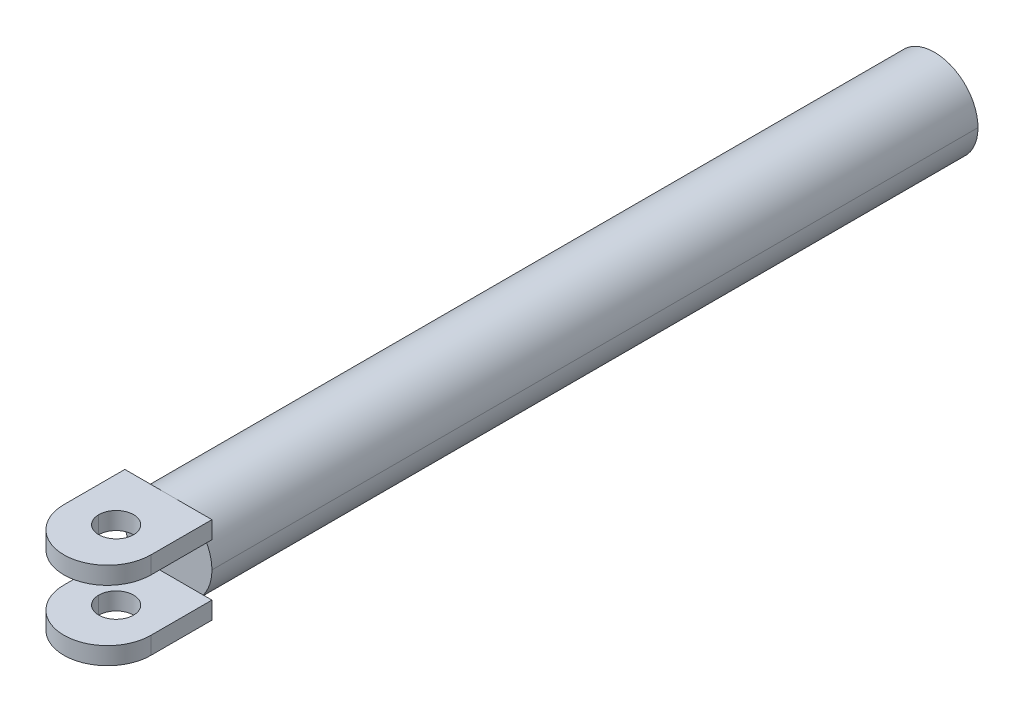
ISO-10303-21;
HEADER;
FILE_DESCRIPTION(('STEP AP214'),'2;1');
FILE_NAME('part.step','',(''),(''),'','','');
FILE_SCHEMA(('AUTOMOTIVE_DESIGN { 1 0 10303 214 1 1 1 1 }'));
ENDSEC;
DATA;
#1=APPLICATION_CONTEXT('core data for automotive mechanical design processes');
#2=APPLICATION_PROTOCOL_DEFINITION('international standard','automotive_design',2000,#1);
#3=PRODUCT_CONTEXT('',#1,'mechanical');
#4=PRODUCT('Part','Part','',(#3));
#5=PRODUCT_RELATED_PRODUCT_CATEGORY('part','',(#4));
#6=PRODUCT_DEFINITION_FORMATION('','',#4);
#7=PRODUCT_DEFINITION_CONTEXT('part definition',#1,'design');
#8=PRODUCT_DEFINITION('design','',#6,#7);
#9=PRODUCT_DEFINITION_SHAPE('','',#8);
#10=(LENGTH_UNIT() NAMED_UNIT(*) SI_UNIT(.MILLI.,.METRE.));
#11=(NAMED_UNIT(*) PLANE_ANGLE_UNIT() SI_UNIT($,.RADIAN.));
#12=(NAMED_UNIT(*) SI_UNIT($,.STERADIAN.) SOLID_ANGLE_UNIT());
#13=UNCERTAINTY_MEASURE_WITH_UNIT(LENGTH_MEASURE(1.E-05),#10,'distance_accuracy_value','');
#14=(GEOMETRIC_REPRESENTATION_CONTEXT(3) GLOBAL_UNCERTAINTY_ASSIGNED_CONTEXT((#13)) GLOBAL_UNIT_ASSIGNED_CONTEXT((#10,
#11,#12)) REPRESENTATION_CONTEXT('',''));
#15=CARTESIAN_POINT('',(0.,0.,0.));
#16=DIRECTION('',(0.,0.,1.));
#17=DIRECTION('',(1.,0.,0.));
#18=AXIS2_PLACEMENT_3D('',#15,#16,#17);
#19=CARTESIAN_POINT('',(0.,25.,470.));
#20=DIRECTION('',(0.,1.,0.));
#21=DIRECTION('',(1.,0.,0.));
#22=AXIS2_PLACEMENT_3D('',#19,#20,#21);
#23=CYLINDRICAL_SURFACE('',#22,10.);
#24=DIRECTION('',(0.,-1.,0.));
#25=VECTOR('',#24,1.);
#26=CARTESIAN_POINT('',(-10.,25.,470.));
#27=LINE('',#26,#25);
#28=CARTESIAN_POINT('',(-10.,25.,470.));
#29=VERTEX_POINT('',#28);
#30=CARTESIAN_POINT('',(-10.,15.,470.));
#31=VERTEX_POINT('',#30);
#32=EDGE_CURVE('E20',#29,#31,#27,.T.);
#33=ORIENTED_EDGE('',*,*,#32,.F.);
#34=CARTESIAN_POINT('',(0.,25.,470.));
#35=DIRECTION('',(0.,1.,0.));
#36=DIRECTION('',(-1.,0.,0.));
#37=AXIS2_PLACEMENT_3D('',#34,#35,#36);
#38=CIRCLE('',#37,10.);
#39=CARTESIAN_POINT('',(10.,25.,470.));
#40=VERTEX_POINT('',#39);
#41=EDGE_CURVE('E266',#29,#40,#38,.T.);
#42=ORIENTED_EDGE('',*,*,#41,.T.);
#43=DIRECTION('',(0.,-1.,0.));
#44=VECTOR('',#43,1.);
#45=CARTESIAN_POINT('',(10.,25.,470.));
#46=LINE('',#45,#44);
#47=CARTESIAN_POINT('',(10.,15.,470.));
#48=VERTEX_POINT('',#47);
#49=EDGE_CURVE('E11',#40,#48,#46,.T.);
#50=ORIENTED_EDGE('',*,*,#49,.T.);
#51=CARTESIAN_POINT('',(0.,15.,470.));
#52=DIRECTION('',(0.,1.,0.));
#53=DIRECTION('',(-1.,0.,0.));
#54=AXIS2_PLACEMENT_3D('',#51,#52,#53);
#55=CIRCLE('',#54,10.);
#56=EDGE_CURVE('E239',#31,#48,#55,.T.);
#57=ORIENTED_EDGE('',*,*,#56,.F.);
#58=EDGE_LOOP('',(#33,#42,#50,#57));
#59=FACE_BOUND('',#58,.T.);
#60=ADVANCED_FACE('F17',(#59),#23,.F.);
#61=CARTESIAN_POINT('',(0.,25.,470.));
#62=DIRECTION('',(0.,1.,0.));
#63=DIRECTION('',(1.,0.,0.));
#64=AXIS2_PLACEMENT_3D('',#61,#62,#63);
#65=CYLINDRICAL_SURFACE('',#64,10.);
#66=ORIENTED_EDGE('',*,*,#49,.F.);
#67=CARTESIAN_POINT('',(0.,25.,470.));
#68=DIRECTION('',(0.,1.,0.));
#69=DIRECTION('',(1.,0.,0.));
#70=AXIS2_PLACEMENT_3D('',#67,#68,#69);
#71=CIRCLE('',#70,10.);
#72=EDGE_CURVE('E263',#40,#29,#71,.T.);
#73=ORIENTED_EDGE('',*,*,#72,.T.);
#74=ORIENTED_EDGE('',*,*,#32,.T.);
#75=CARTESIAN_POINT('',(0.,15.,470.));
#76=DIRECTION('',(0.,1.,0.));
#77=DIRECTION('',(1.,0.,0.));
#78=AXIS2_PLACEMENT_3D('',#75,#76,#77);
#79=CIRCLE('',#78,10.);
#80=EDGE_CURVE('E243',#48,#31,#79,.T.);
#81=ORIENTED_EDGE('',*,*,#80,.F.);
#82=EDGE_LOOP('',(#66,#73,#74,#81));
#83=FACE_BOUND('',#82,.T.);
#84=ADVANCED_FACE('F286',(#83),#65,.F.);
#85=CARTESIAN_POINT('',(25.,0.,0.));
#86=DIRECTION('',(1.,0.,0.));
#87=DIRECTION('',(0.,-1.,0.));
#88=AXIS2_PLACEMENT_3D('',#85,#86,#87);
#89=PLANE('',#88);
#90=DIRECTION('',(0.,0.,-1.));
#91=VECTOR('',#90,1.);
#92=CARTESIAN_POINT('',(25.,15.,475.));
#93=LINE('',#92,#91);
#94=CARTESIAN_POINT('',(25.,15.,475.));
#95=VERTEX_POINT('',#94);
#96=CARTESIAN_POINT('',(25.,15.,440.));
#97=VERTEX_POINT('',#96);
#98=EDGE_CURVE('E232',#95,#97,#93,.T.);
#99=ORIENTED_EDGE('',*,*,#98,.T.);
#100=DIRECTION('',(0.,1.,0.));
#101=VECTOR('',#100,1.);
#102=CARTESIAN_POINT('',(25.,15.,440.));
#103=LINE('',#102,#101);
#104=CARTESIAN_POINT('',(25.,25.,440.));
#105=VERTEX_POINT('',#104);
#106=EDGE_CURVE('E268',#97,#105,#103,.T.);
#107=ORIENTED_EDGE('',*,*,#106,.T.);
#108=DIRECTION('',(0.,0.,1.));
#109=VECTOR('',#108,1.);
#110=CARTESIAN_POINT('',(25.,25.,440.));
#111=LINE('',#110,#109);
#112=CARTESIAN_POINT('',(25.,25.,475.));
#113=VERTEX_POINT('',#112);
#114=EDGE_CURVE('E262',#105,#113,#111,.T.);
#115=ORIENTED_EDGE('',*,*,#114,.T.);
#116=DIRECTION('',(0.,1.,0.));
#117=VECTOR('',#116,1.);
#118=CARTESIAN_POINT('',(25.,15.,475.));
#119=LINE('',#118,#117);
#120=EDGE_CURVE('E249',#95,#113,#119,.T.);
#121=ORIENTED_EDGE('',*,*,#120,.F.);
#122=EDGE_LOOP('',(#99,#107,#115,#121));
#123=FACE_BOUND('',#122,.T.);
#124=ADVANCED_FACE('F300',(#123),#89,.T.);
#125=CARTESIAN_POINT('',(-25.,-25.,440.));
#126=DIRECTION('',(0.,0.,-1.));
#127=DIRECTION('',(0.,1.,0.));
#128=AXIS2_PLACEMENT_3D('',#125,#126,#127);
#129=PLANE('',#128);
#130=CARTESIAN_POINT('',(0.,0.,440.));
#131=DIRECTION('',(0.,0.,1.));
#132=DIRECTION('',(0.8,0.6,0.));
#133=AXIS2_PLACEMENT_3D('',#130,#131,#132);
#134=CIRCLE('',#133,25.);
#135=CARTESIAN_POINT('',(20.,15.,440.));
#136=VERTEX_POINT('',#135);
#137=CARTESIAN_POINT('',(0.,25.,440.));
#138=VERTEX_POINT('',#137);
#139=EDGE_CURVE('E160',#136,#138,#134,.T.);
#140=ORIENTED_EDGE('',*,*,#139,.T.);
#141=DIRECTION('',(1.,0.,0.));
#142=VECTOR('',#141,1.);
#143=CARTESIAN_POINT('',(0.,25.,440.));
#144=LINE('',#143,#142);
#145=EDGE_CURVE('E259',#138,#105,#144,.T.);
#146=ORIENTED_EDGE('',*,*,#145,.T.);
#147=ORIENTED_EDGE('',*,*,#106,.F.);
#148=DIRECTION('',(1.,0.,0.));
#149=VECTOR('',#148,1.);
#150=CARTESIAN_POINT('',(20.,15.,440.));
#151=LINE('',#150,#149);
#152=EDGE_CURVE('E254',#136,#97,#151,.T.);
#153=ORIENTED_EDGE('',*,*,#152,.F.);
#154=EDGE_LOOP('',(#140,#146,#147,#153));
#155=FACE_BOUND('',#154,.T.);
#156=ADVANCED_FACE('F294',(#155),#129,.T.);
#157=CARTESIAN_POINT('',(-25.,25.,440.));
#158=DIRECTION('',(0.,1.,0.));
#159=DIRECTION('',(0.,0.,1.));
#160=AXIS2_PLACEMENT_3D('',#157,#158,#159);
#161=PLANE('',#160);
#162=ORIENTED_EDGE('',*,*,#41,.F.);
#163=ORIENTED_EDGE('',*,*,#72,.F.);
#164=EDGE_LOOP('',(#162,#163));
#165=FACE_BOUND('',#164,.T.);
#166=ORIENTED_EDGE('',*,*,#114,.F.);
#167=ORIENTED_EDGE('',*,*,#145,.F.);
#168=DIRECTION('',(1.,0.,0.));
#169=VECTOR('',#168,1.);
#170=CARTESIAN_POINT('',(-25.,25.,440.));
#171=LINE('',#170,#169);
#172=CARTESIAN_POINT('',(-25.,25.,440.));
#173=VERTEX_POINT('',#172);
#174=EDGE_CURVE('E251',#173,#138,#171,.T.);
#175=ORIENTED_EDGE('',*,*,#174,.F.);
#176=DIRECTION('',(0.,0.,1.));
#177=VECTOR('',#176,1.);
#178=CARTESIAN_POINT('',(-25.,25.,440.));
#179=LINE('',#178,#177);
#180=CARTESIAN_POINT('',(-25.,25.,475.));
#181=VERTEX_POINT('',#180);
#182=EDGE_CURVE('E248',#173,#181,#179,.T.);
#183=ORIENTED_EDGE('',*,*,#182,.T.);
#184=CARTESIAN_POINT('',(0.,25.,475.));
#185=DIRECTION('',(0.,-1.,0.));
#186=DIRECTION('',(1.,0.,0.));
#187=AXIS2_PLACEMENT_3D('',#184,#185,#186);
#188=CIRCLE('',#187,25.);
#189=EDGE_CURVE('E238',#113,#181,#188,.T.);
#190=ORIENTED_EDGE('',*,*,#189,.F.);
#191=EDGE_LOOP('',(#166,#167,#175,#183,#190));
#192=FACE_BOUND('',#191,.T.);
#193=ADVANCED_FACE('F290',(#165,#192),#161,.T.);
#194=CARTESIAN_POINT('',(-25.,-25.,440.));
#195=DIRECTION('',(0.,0.,-1.));
#196=DIRECTION('',(0.,1.,0.));
#197=AXIS2_PLACEMENT_3D('',#194,#195,#196);
#198=PLANE('',#197);
#199=DIRECTION('',(0.,1.,0.));
#200=VECTOR('',#199,1.);
#201=CARTESIAN_POINT('',(-25.,15.,440.));
#202=LINE('',#201,#200);
#203=CARTESIAN_POINT('',(-25.,15.,440.));
#204=VERTEX_POINT('',#203);
#205=EDGE_CURVE('E245',#204,#173,#202,.T.);
#206=ORIENTED_EDGE('',*,*,#205,.T.);
#207=ORIENTED_EDGE('',*,*,#174,.T.);
#208=CARTESIAN_POINT('',(0.,0.,440.));
#209=DIRECTION('',(0.,0.,1.));
#210=DIRECTION('',(0.,1.,0.));
#211=AXIS2_PLACEMENT_3D('',#208,#209,#210);
#212=CIRCLE('',#211,25.);
#213=CARTESIAN_POINT('',(-20.,15.,440.));
#214=VERTEX_POINT('',#213);
#215=EDGE_CURVE('E162',#138,#214,#212,.T.);
#216=ORIENTED_EDGE('',*,*,#215,.T.);
#217=DIRECTION('',(1.,0.,0.));
#218=VECTOR('',#217,1.);
#219=CARTESIAN_POINT('',(-25.,15.,440.));
#220=LINE('',#219,#218);
#221=EDGE_CURVE('E244',#204,#214,#220,.T.);
#222=ORIENTED_EDGE('',*,*,#221,.F.);
#223=EDGE_LOOP('',(#206,#207,#216,#222));
#224=FACE_BOUND('',#223,.T.);
#225=ADVANCED_FACE('F293',(#224),#198,.T.);
#226=CARTESIAN_POINT('',(-25.,0.,0.));
#227=DIRECTION('',(1.,0.,0.));
#228=DIRECTION('',(0.,-1.,0.));
#229=AXIS2_PLACEMENT_3D('',#226,#227,#228);
#230=PLANE('',#229);
#231=ORIENTED_EDGE('',*,*,#182,.F.);
#232=ORIENTED_EDGE('',*,*,#205,.F.);
#233=DIRECTION('',(0.,0.,-1.));
#234=VECTOR('',#233,1.);
#235=CARTESIAN_POINT('',(-25.,15.,475.));
#236=LINE('',#235,#234);
#237=CARTESIAN_POINT('',(-25.,15.,475.));
#238=VERTEX_POINT('',#237);
#239=EDGE_CURVE('E240',#238,#204,#236,.T.);
#240=ORIENTED_EDGE('',*,*,#239,.F.);
#241=DIRECTION('',(0.,-1.,0.));
#242=VECTOR('',#241,1.);
#243=CARTESIAN_POINT('',(-25.,25.,475.));
#244=LINE('',#243,#242);
#245=EDGE_CURVE('E235',#181,#238,#244,.T.);
#246=ORIENTED_EDGE('',*,*,#245,.F.);
#247=EDGE_LOOP('',(#231,#232,#240,#246));
#248=FACE_BOUND('',#247,.T.);
#249=ADVANCED_FACE('F359',(#248),#230,.F.);
#250=CARTESIAN_POINT('',(0.,-90.2542748175507,475.));
#251=DIRECTION('',(0.,1.,0.));
#252=DIRECTION('',(0.,0.,1.));
#253=AXIS2_PLACEMENT_3D('',#250,#251,#252);
#254=CYLINDRICAL_SURFACE('',#253,25.);
#255=ORIENTED_EDGE('',*,*,#120,.T.);
#256=ORIENTED_EDGE('',*,*,#189,.T.);
#257=ORIENTED_EDGE('',*,*,#245,.T.);
#258=CARTESIAN_POINT('',(0.,15.,475.));
#259=DIRECTION('',(0.,1.,0.));
#260=DIRECTION('',(-1.,0.,0.));
#261=AXIS2_PLACEMENT_3D('',#258,#259,#260);
#262=CIRCLE('',#261,25.);
#263=EDGE_CURVE('E229',#238,#95,#262,.T.);
#264=ORIENTED_EDGE('',*,*,#263,.T.);
#265=EDGE_LOOP('',(#255,#256,#257,#264));
#266=FACE_BOUND('',#265,.T.);
#267=ADVANCED_FACE('F362',(#266),#254,.T.);
#268=CARTESIAN_POINT('',(0.,15.,0.));
#269=DIRECTION('',(0.,1.,0.));
#270=DIRECTION('',(1.,0.,0.));
#271=AXIS2_PLACEMENT_3D('',#268,#269,#270);
#272=PLANE('',#271);
#273=ORIENTED_EDGE('',*,*,#56,.T.);
#274=ORIENTED_EDGE('',*,*,#80,.T.);
#275=EDGE_LOOP('',(#273,#274));
#276=FACE_BOUND('',#275,.T.);
#277=ORIENTED_EDGE('',*,*,#239,.T.);
#278=ORIENTED_EDGE('',*,*,#221,.T.);
#279=DIRECTION('',(-1.,0.,0.));
#280=VECTOR('',#279,1.);
#281=CARTESIAN_POINT('',(20.,15.,440.));
#282=LINE('',#281,#280);
#283=EDGE_CURVE('E170',#136,#214,#282,.T.);
#284=ORIENTED_EDGE('',*,*,#283,.F.);
#285=ORIENTED_EDGE('',*,*,#152,.T.);
#286=ORIENTED_EDGE('',*,*,#98,.F.);
#287=ORIENTED_EDGE('',*,*,#263,.F.);
#288=EDGE_LOOP('',(#277,#278,#284,#285,#286,#287));
#289=FACE_BOUND('',#288,.T.);
#290=ADVANCED_FACE('F279',(#276,#289),#272,.F.);
#291=CARTESIAN_POINT('',(0.,25.,470.));
#292=DIRECTION('',(0.,1.,0.));
#293=DIRECTION('',(1.,0.,0.));
#294=AXIS2_PLACEMENT_3D('',#291,#292,#293);
#295=CYLINDRICAL_SURFACE('',#294,10.);
#296=DIRECTION('',(0.,-1.,0.));
#297=VECTOR('',#296,1.);
#298=CARTESIAN_POINT('',(10.,-15.,470.));
#299=LINE('',#298,#297);
#300=CARTESIAN_POINT('',(10.,-15.,470.));
#301=VERTEX_POINT('',#300);
#302=CARTESIAN_POINT('',(10.,-25.,470.));
#303=VERTEX_POINT('',#302);
#304=EDGE_CURVE('E209',#301,#303,#299,.T.);
#305=ORIENTED_EDGE('',*,*,#304,.T.);
#306=CARTESIAN_POINT('',(0.,-25.,470.));
#307=DIRECTION('',(0.,1.,0.));
#308=DIRECTION('',(-1.,0.,0.));
#309=AXIS2_PLACEMENT_3D('',#306,#307,#308);
#310=CIRCLE('',#309,10.);
#311=CARTESIAN_POINT('',(-10.,-25.,470.));
#312=VERTEX_POINT('',#311);
#313=EDGE_CURVE('E197',#312,#303,#310,.T.);
#314=ORIENTED_EDGE('',*,*,#313,.F.);
#315=DIRECTION('',(0.,-1.,0.));
#316=VECTOR('',#315,1.);
#317=CARTESIAN_POINT('',(-10.,-15.,470.));
#318=LINE('',#317,#316);
#319=CARTESIAN_POINT('',(-10.,-15.,470.));
#320=VERTEX_POINT('',#319);
#321=EDGE_CURVE('E225',#320,#312,#318,.T.);
#322=ORIENTED_EDGE('',*,*,#321,.F.);
#323=CARTESIAN_POINT('',(0.,-15.,470.));
#324=DIRECTION('',(0.,1.,0.));
#325=DIRECTION('',(-1.,0.,0.));
#326=AXIS2_PLACEMENT_3D('',#323,#324,#325);
#327=CIRCLE('',#326,10.);
#328=EDGE_CURVE('E193',#320,#301,#327,.T.);
#329=ORIENTED_EDGE('',*,*,#328,.T.);
#330=EDGE_LOOP('',(#305,#314,#322,#329));
#331=FACE_BOUND('',#330,.T.);
#332=ADVANCED_FACE('F343',(#331),#295,.F.);
#333=CARTESIAN_POINT('',(0.,25.,470.));
#334=DIRECTION('',(0.,1.,0.));
#335=DIRECTION('',(1.,0.,0.));
#336=AXIS2_PLACEMENT_3D('',#333,#334,#335);
#337=CYLINDRICAL_SURFACE('',#336,10.);
#338=ORIENTED_EDGE('',*,*,#321,.T.);
#339=CARTESIAN_POINT('',(0.,-25.,470.));
#340=DIRECTION('',(0.,1.,0.));
#341=DIRECTION('',(1.,0.,0.));
#342=AXIS2_PLACEMENT_3D('',#339,#340,#341);
#343=CIRCLE('',#342,10.);
#344=EDGE_CURVE('E194',#303,#312,#343,.T.);
#345=ORIENTED_EDGE('',*,*,#344,.F.);
#346=ORIENTED_EDGE('',*,*,#304,.F.);
#347=CARTESIAN_POINT('',(0.,-15.,470.));
#348=DIRECTION('',(0.,1.,0.));
#349=DIRECTION('',(1.,0.,0.));
#350=AXIS2_PLACEMENT_3D('',#347,#348,#349);
#351=CIRCLE('',#350,10.);
#352=EDGE_CURVE('E206',#301,#320,#351,.T.);
#353=ORIENTED_EDGE('',*,*,#352,.T.);
#354=EDGE_LOOP('',(#338,#345,#346,#353));
#355=FACE_BOUND('',#354,.T.);
#356=ADVANCED_FACE('F335',(#355),#337,.F.);
#357=CARTESIAN_POINT('',(-25.,0.,0.));
#358=DIRECTION('',(1.,0.,0.));
#359=DIRECTION('',(0.,-1.,0.));
#360=AXIS2_PLACEMENT_3D('',#357,#358,#359);
#361=PLANE('',#360);
#362=DIRECTION('',(0.,0.,-1.));
#363=VECTOR('',#362,1.);
#364=CARTESIAN_POINT('',(-25.,-15.,475.));
#365=LINE('',#364,#363);
#366=CARTESIAN_POINT('',(-25.,-15.,475.));
#367=VERTEX_POINT('',#366);
#368=CARTESIAN_POINT('',(-25.,-15.,440.));
#369=VERTEX_POINT('',#368);
#370=EDGE_CURVE('E188',#367,#369,#365,.T.);
#371=ORIENTED_EDGE('',*,*,#370,.T.);
#372=DIRECTION('',(0.,1.,0.));
#373=VECTOR('',#372,1.);
#374=CARTESIAN_POINT('',(-25.,-25.,440.));
#375=LINE('',#374,#373);
#376=CARTESIAN_POINT('',(-25.,-25.,440.));
#377=VERTEX_POINT('',#376);
#378=EDGE_CURVE('E182',#377,#369,#375,.T.);
#379=ORIENTED_EDGE('',*,*,#378,.F.);
#380=DIRECTION('',(0.,0.,-1.));
#381=VECTOR('',#380,1.);
#382=CARTESIAN_POINT('',(-25.,-25.,475.));
#383=LINE('',#382,#381);
#384=CARTESIAN_POINT('',(-25.,-25.,475.));
#385=VERTEX_POINT('',#384);
#386=EDGE_CURVE('E198',#385,#377,#383,.T.);
#387=ORIENTED_EDGE('',*,*,#386,.F.);
#388=DIRECTION('',(0.,-1.,0.));
#389=VECTOR('',#388,1.);
#390=CARTESIAN_POINT('',(-25.,-15.,475.));
#391=LINE('',#390,#389);
#392=EDGE_CURVE('E40',#367,#385,#391,.T.);
#393=ORIENTED_EDGE('',*,*,#392,.F.);
#394=EDGE_LOOP('',(#371,#379,#387,#393));
#395=FACE_BOUND('',#394,.T.);
#396=ADVANCED_FACE('F333',(#395),#361,.F.);
#397=CARTESIAN_POINT('',(-25.,-25.,440.));
#398=DIRECTION('',(0.,0.,-1.));
#399=DIRECTION('',(0.,1.,0.));
#400=AXIS2_PLACEMENT_3D('',#397,#398,#399);
#401=PLANE('',#400);
#402=DIRECTION('',(0.,1.,0.));
#403=VECTOR('',#402,1.);
#404=CARTESIAN_POINT('',(25.,-25.,440.));
#405=LINE('',#404,#403);
#406=CARTESIAN_POINT('',(25.,-25.,440.));
#407=VERTEX_POINT('',#406);
#408=CARTESIAN_POINT('',(25.,-15.,440.));
#409=VERTEX_POINT('',#408);
#410=EDGE_CURVE('E201',#407,#409,#405,.T.);
#411=ORIENTED_EDGE('',*,*,#410,.F.);
#412=DIRECTION('',(1.,0.,0.));
#413=VECTOR('',#412,1.);
#414=CARTESIAN_POINT('',(0.,-25.,440.));
#415=LINE('',#414,#413);
#416=CARTESIAN_POINT('',(0.,-25.,440.));
#417=VERTEX_POINT('',#416);
#418=EDGE_CURVE('E212',#417,#407,#415,.T.);
#419=ORIENTED_EDGE('',*,*,#418,.F.);
#420=CARTESIAN_POINT('',(0.,0.,440.));
#421=DIRECTION('',(0.,0.,1.));
#422=DIRECTION('',(0.,-1.,0.));
#423=AXIS2_PLACEMENT_3D('',#420,#421,#422);
#424=CIRCLE('',#423,25.);
#425=CARTESIAN_POINT('',(20.,-15.,440.));
#426=VERTEX_POINT('',#425);
#427=EDGE_CURVE('E175',#417,#426,#424,.T.);
#428=ORIENTED_EDGE('',*,*,#427,.T.);
#429=DIRECTION('',(1.,0.,0.));
#430=VECTOR('',#429,1.);
#431=CARTESIAN_POINT('',(20.,-15.,440.));
#432=LINE('',#431,#430);
#433=EDGE_CURVE('E207',#426,#409,#432,.T.);
#434=ORIENTED_EDGE('',*,*,#433,.T.);
#435=EDGE_LOOP('',(#411,#419,#428,#434));
#436=FACE_BOUND('',#435,.T.);
#437=ADVANCED_FACE('F317',(#436),#401,.T.);
#438=CARTESIAN_POINT('',(25.,0.,0.));
#439=DIRECTION('',(1.,0.,0.));
#440=DIRECTION('',(0.,-1.,0.));
#441=AXIS2_PLACEMENT_3D('',#438,#439,#440);
#442=PLANE('',#441);
#443=DIRECTION('',(0.,0.,-1.));
#444=VECTOR('',#443,1.);
#445=CARTESIAN_POINT('',(25.,-25.,475.));
#446=LINE('',#445,#444);
#447=CARTESIAN_POINT('',(25.,-25.,475.));
#448=VERTEX_POINT('',#447);
#449=EDGE_CURVE('E204',#448,#407,#446,.T.);
#450=ORIENTED_EDGE('',*,*,#449,.T.);
#451=ORIENTED_EDGE('',*,*,#410,.T.);
#452=DIRECTION('',(0.,0.,-1.));
#453=VECTOR('',#452,1.);
#454=CARTESIAN_POINT('',(25.,-15.,475.));
#455=LINE('',#454,#453);
#456=CARTESIAN_POINT('',(25.,-15.,475.));
#457=VERTEX_POINT('',#456);
#458=EDGE_CURVE('E32',#457,#409,#455,.T.);
#459=ORIENTED_EDGE('',*,*,#458,.F.);
#460=DIRECTION('',(0.,1.,0.));
#461=VECTOR('',#460,1.);
#462=CARTESIAN_POINT('',(25.,-25.,475.));
#463=LINE('',#462,#461);
#464=EDGE_CURVE('E202',#448,#457,#463,.T.);
#465=ORIENTED_EDGE('',*,*,#464,.F.);
#466=EDGE_LOOP('',(#450,#451,#459,#465));
#467=FACE_BOUND('',#466,.T.);
#468=ADVANCED_FACE('F327',(#467),#442,.T.);
#469=CARTESIAN_POINT('',(-25.,-25.,500.));
#470=DIRECTION('',(0.,-1.,0.));
#471=DIRECTION('',(0.,0.,-1.));
#472=AXIS2_PLACEMENT_3D('',#469,#470,#471);
#473=PLANE('',#472);
#474=ORIENTED_EDGE('',*,*,#313,.T.);
#475=ORIENTED_EDGE('',*,*,#344,.T.);
#476=EDGE_LOOP('',(#474,#475));
#477=FACE_BOUND('',#476,.T.);
#478=ORIENTED_EDGE('',*,*,#386,.T.);
#479=DIRECTION('',(1.,0.,0.));
#480=VECTOR('',#479,1.);
#481=CARTESIAN_POINT('',(-25.,-25.,440.));
#482=LINE('',#481,#480);
#483=EDGE_CURVE('E183',#377,#417,#482,.T.);
#484=ORIENTED_EDGE('',*,*,#483,.T.);
#485=ORIENTED_EDGE('',*,*,#418,.T.);
#486=ORIENTED_EDGE('',*,*,#449,.F.);
#487=CARTESIAN_POINT('',(0.,-25.,475.));
#488=DIRECTION('',(0.,1.,0.));
#489=DIRECTION('',(-1.,0.,0.));
#490=AXIS2_PLACEMENT_3D('',#487,#488,#489);
#491=CIRCLE('',#490,25.);
#492=EDGE_CURVE('E190',#385,#448,#491,.T.);
#493=ORIENTED_EDGE('',*,*,#492,.F.);
#494=EDGE_LOOP('',(#478,#484,#485,#486,#493));
#495=FACE_BOUND('',#494,.T.);
#496=ADVANCED_FACE('F329',(#477,#495),#473,.T.);
#497=CARTESIAN_POINT('',(0.,-90.2542748175507,475.));
#498=DIRECTION('',(0.,1.,0.));
#499=DIRECTION('',(0.,0.,1.));
#500=AXIS2_PLACEMENT_3D('',#497,#498,#499);
#501=CYLINDRICAL_SURFACE('',#500,25.);
#502=ORIENTED_EDGE('',*,*,#464,.T.);
#503=CARTESIAN_POINT('',(0.,-15.,475.));
#504=DIRECTION('',(0.,-1.,0.));
#505=DIRECTION('',(1.,0.,0.));
#506=AXIS2_PLACEMENT_3D('',#503,#504,#505);
#507=CIRCLE('',#506,25.);
#508=EDGE_CURVE('E186',#457,#367,#507,.T.);
#509=ORIENTED_EDGE('',*,*,#508,.T.);
#510=ORIENTED_EDGE('',*,*,#392,.T.);
#511=ORIENTED_EDGE('',*,*,#492,.T.);
#512=EDGE_LOOP('',(#502,#509,#510,#511));
#513=FACE_BOUND('',#512,.T.);
#514=ADVANCED_FACE('F324',(#513),#501,.T.);
#515=CARTESIAN_POINT('',(0.,-15.,0.));
#516=DIRECTION('',(0.,1.,0.));
#517=DIRECTION('',(1.,0.,0.));
#518=AXIS2_PLACEMENT_3D('',#515,#516,#517);
#519=PLANE('',#518);
#520=ORIENTED_EDGE('',*,*,#328,.F.);
#521=ORIENTED_EDGE('',*,*,#352,.F.);
#522=EDGE_LOOP('',(#520,#521));
#523=FACE_BOUND('',#522,.T.);
#524=ORIENTED_EDGE('',*,*,#458,.T.);
#525=ORIENTED_EDGE('',*,*,#433,.F.);
#526=DIRECTION('',(-1.,0.,0.));
#527=VECTOR('',#526,1.);
#528=CARTESIAN_POINT('',(20.,-15.,440.));
#529=LINE('',#528,#527);
#530=CARTESIAN_POINT('',(-20.,-15.,440.));
#531=VERTEX_POINT('',#530);
#532=EDGE_CURVE('E171',#426,#531,#529,.T.);
#533=ORIENTED_EDGE('',*,*,#532,.T.);
#534=DIRECTION('',(1.,0.,0.));
#535=VECTOR('',#534,1.);
#536=CARTESIAN_POINT('',(-25.,-15.,440.));
#537=LINE('',#536,#535);
#538=EDGE_CURVE('E177',#369,#531,#537,.T.);
#539=ORIENTED_EDGE('',*,*,#538,.F.);
#540=ORIENTED_EDGE('',*,*,#370,.F.);
#541=ORIENTED_EDGE('',*,*,#508,.F.);
#542=EDGE_LOOP('',(#524,#525,#533,#539,#540,#541));
#543=FACE_BOUND('',#542,.T.);
#544=ADVANCED_FACE('F319',(#523,#543),#519,.T.);
#545=CARTESIAN_POINT('',(-25.,-25.,440.));
#546=DIRECTION('',(0.,0.,-1.));
#547=DIRECTION('',(0.,1.,0.));
#548=AXIS2_PLACEMENT_3D('',#545,#546,#547);
#549=PLANE('',#548);
#550=CARTESIAN_POINT('',(0.,0.,440.));
#551=DIRECTION('',(0.,0.,1.));
#552=DIRECTION('',(-0.8,-0.6,0.));
#553=AXIS2_PLACEMENT_3D('',#550,#551,#552);
#554=CIRCLE('',#553,25.);
#555=EDGE_CURVE('E172',#531,#417,#554,.T.);
#556=ORIENTED_EDGE('',*,*,#555,.T.);
#557=ORIENTED_EDGE('',*,*,#483,.F.);
#558=ORIENTED_EDGE('',*,*,#378,.T.);
#559=ORIENTED_EDGE('',*,*,#538,.T.);
#560=EDGE_LOOP('',(#556,#557,#558,#559));
#561=FACE_BOUND('',#560,.T.);
#562=ADVANCED_FACE('F332',(#561),#549,.T.);
#563=CARTESIAN_POINT('',(0.,0.,0.));
#564=DIRECTION('',(0.,0.,1.));
#565=DIRECTION('',(1.,0.,0.));
#566=AXIS2_PLACEMENT_3D('',#563,#564,#565);
#567=CYLINDRICAL_SURFACE('',#566,25.);
#568=DIRECTION('',(0.,0.,1.));
#569=VECTOR('',#568,1.);
#570=CARTESIAN_POINT('',(-25.,0.,0.));
#571=LINE('',#570,#569);
#572=CARTESIAN_POINT('',(-25.,0.,0.));
#573=VERTEX_POINT('',#572);
#574=CARTESIAN_POINT('',(-25.,0.,440.));
#575=VERTEX_POINT('',#574);
#576=EDGE_CURVE('E142',#573,#575,#571,.T.);
#577=ORIENTED_EDGE('',*,*,#576,.F.);
#578=CARTESIAN_POINT('',(0.,0.,0.));
#579=DIRECTION('',(0.,0.,1.));
#580=DIRECTION('',(-1.,0.,0.));
#581=AXIS2_PLACEMENT_3D('',#578,#579,#580);
#582=CIRCLE('',#581,25.);
#583=CARTESIAN_POINT('',(25.,0.,0.));
#584=VERTEX_POINT('',#583);
#585=EDGE_CURVE('E135',#573,#584,#582,.T.);
#586=ORIENTED_EDGE('',*,*,#585,.T.);
#587=DIRECTION('',(0.,0.,1.));
#588=VECTOR('',#587,1.);
#589=CARTESIAN_POINT('',(25.,0.,0.));
#590=LINE('',#589,#588);
#591=CARTESIAN_POINT('',(25.,0.,440.));
#592=VERTEX_POINT('',#591);
#593=EDGE_CURVE('E139',#584,#592,#590,.T.);
#594=ORIENTED_EDGE('',*,*,#593,.T.);
#595=CARTESIAN_POINT('',(0.,0.,440.));
#596=DIRECTION('',(0.,0.,1.));
#597=DIRECTION('',(0.8,-0.6,0.));
#598=AXIS2_PLACEMENT_3D('',#595,#596,#597);
#599=CIRCLE('',#598,25.);
#600=EDGE_CURVE('E154',#426,#592,#599,.T.);
#601=ORIENTED_EDGE('',*,*,#600,.F.);
#602=ORIENTED_EDGE('',*,*,#427,.F.);
#603=ORIENTED_EDGE('',*,*,#555,.F.);
#604=CARTESIAN_POINT('',(0.,0.,440.));
#605=DIRECTION('',(0.,0.,1.));
#606=DIRECTION('',(-1.,0.,0.));
#607=AXIS2_PLACEMENT_3D('',#604,#605,#606);
#608=CIRCLE('',#607,25.);
#609=EDGE_CURVE('E167',#575,#531,#608,.T.);
#610=ORIENTED_EDGE('',*,*,#609,.F.);
#611=EDGE_LOOP('',(#577,#586,#594,#601,#602,#603,#610));
#612=FACE_BOUND('',#611,.T.);
#613=ADVANCED_FACE('F137',(#612),#567,.T.);
#614=CARTESIAN_POINT('',(25.,-15.,440.));
#615=DIRECTION('',(0.,0.,-1.));
#616=DIRECTION('',(-1.,0.,0.));
#617=AXIS2_PLACEMENT_3D('',#614,#615,#616);
#618=PLANE('',#617);
#619=ORIENTED_EDGE('',*,*,#283,.T.);
#620=CARTESIAN_POINT('',(0.,0.,440.));
#621=DIRECTION('',(0.,0.,1.));
#622=DIRECTION('',(-0.8,0.6,0.));
#623=AXIS2_PLACEMENT_3D('',#620,#621,#622);
#624=CIRCLE('',#623,25.);
#625=EDGE_CURVE('E164',#214,#575,#624,.T.);
#626=ORIENTED_EDGE('',*,*,#625,.T.);
#627=ORIENTED_EDGE('',*,*,#609,.T.);
#628=ORIENTED_EDGE('',*,*,#532,.F.);
#629=ORIENTED_EDGE('',*,*,#600,.T.);
#630=CARTESIAN_POINT('',(0.,0.,440.));
#631=DIRECTION('',(0.,0.,1.));
#632=DIRECTION('',(1.,0.,0.));
#633=AXIS2_PLACEMENT_3D('',#630,#631,#632);
#634=CIRCLE('',#633,25.);
#635=EDGE_CURVE('E146',#592,#136,#634,.T.);
#636=ORIENTED_EDGE('',*,*,#635,.T.);
#637=EDGE_LOOP('',(#619,#626,#627,#628,#629,#636));
#638=FACE_BOUND('',#637,.T.);
#639=ADVANCED_FACE('F311',(#638),#618,.F.);
#640=CARTESIAN_POINT('',(0.,0.,0.));
#641=DIRECTION('',(0.,0.,1.));
#642=DIRECTION('',(1.,0.,0.));
#643=AXIS2_PLACEMENT_3D('',#640,#641,#642);
#644=CYLINDRICAL_SURFACE('',#643,25.);
#645=ORIENTED_EDGE('',*,*,#593,.F.);
#646=CARTESIAN_POINT('',(0.,0.,0.));
#647=DIRECTION('',(0.,0.,1.));
#648=DIRECTION('',(1.,0.,0.));
#649=AXIS2_PLACEMENT_3D('',#646,#647,#648);
#650=CIRCLE('',#649,25.);
#651=EDGE_CURVE('E147',#584,#573,#650,.T.);
#652=ORIENTED_EDGE('',*,*,#651,.T.);
#653=ORIENTED_EDGE('',*,*,#576,.T.);
#654=ORIENTED_EDGE('',*,*,#625,.F.);
#655=ORIENTED_EDGE('',*,*,#215,.F.);
#656=ORIENTED_EDGE('',*,*,#139,.F.);
#657=ORIENTED_EDGE('',*,*,#635,.F.);
#658=EDGE_LOOP('',(#645,#652,#653,#654,#655,#656,#657));
#659=FACE_BOUND('',#658,.T.);
#660=ADVANCED_FACE('F151',(#659),#644,.T.);
#661=CARTESIAN_POINT('',(0.,0.,0.));
#662=DIRECTION('',(0.,0.,1.));
#663=DIRECTION('',(1.,0.,0.));
#664=AXIS2_PLACEMENT_3D('',#661,#662,#663);
#665=PLANE('',#664);
#666=ORIENTED_EDGE('',*,*,#585,.F.);
#667=ORIENTED_EDGE('',*,*,#651,.F.);
#668=EDGE_LOOP('',(#666,#667));
#669=FACE_BOUND('',#668,.T.);
#670=ADVANCED_FACE('F156',(#669),#665,.F.);
#671=CLOSED_SHELL('',(#60,#84,#124,#156,#193,#225,#249,#267,#290,#332,#356,#396,#437,#468,#496,
#514,#544,#562,#613,#639,#660,#670));
#672=MANIFOLD_SOLID_BREP('B1',#671);
#673=ADVANCED_BREP_SHAPE_REPRESENTATION('',(#18,#672),#14);
#674=SHAPE_DEFINITION_REPRESENTATION(#9,#673);
ENDSEC;
END-ISO-10303-21;
